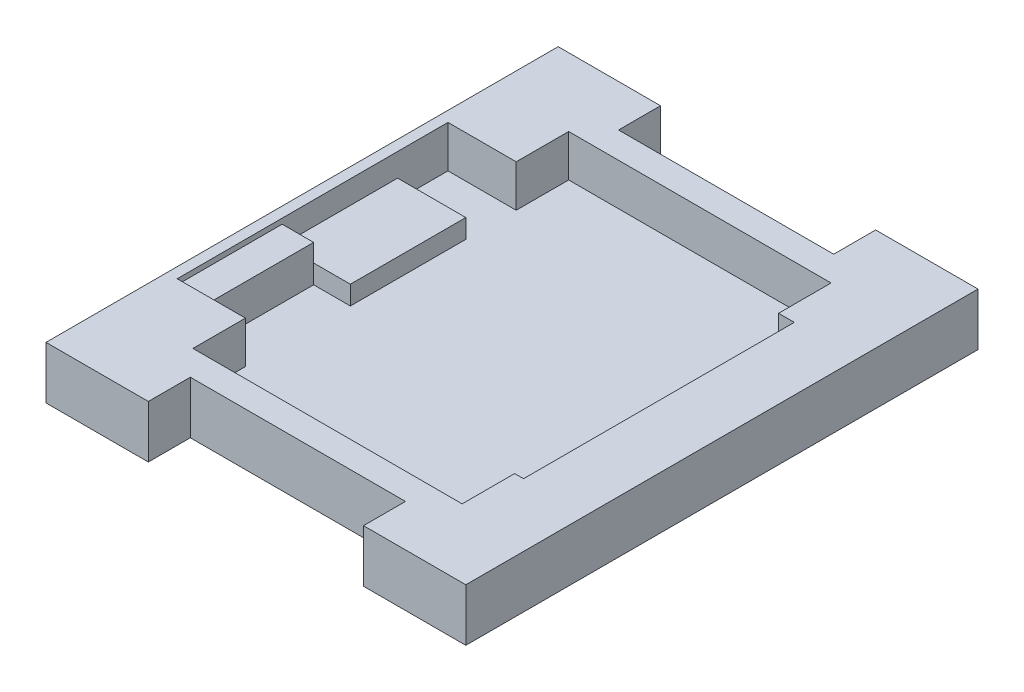
ISO-10303-21;
HEADER;
FILE_DESCRIPTION(('STEP AP214'),'2;1');
FILE_NAME('part.step','',(''),(''),'','','');
FILE_SCHEMA(('AUTOMOTIVE_DESIGN { 1 0 10303 214 1 1 1 1 }'));
ENDSEC;
DATA;
#1=APPLICATION_CONTEXT('core data for automotive mechanical design processes');
#2=APPLICATION_PROTOCOL_DEFINITION('international standard','automotive_design',2000,#1);
#3=PRODUCT_CONTEXT('',#1,'mechanical');
#4=PRODUCT('Part','Part','',(#3));
#5=PRODUCT_RELATED_PRODUCT_CATEGORY('part','',(#4));
#6=PRODUCT_DEFINITION_FORMATION('','',#4);
#7=PRODUCT_DEFINITION_CONTEXT('part definition',#1,'design');
#8=PRODUCT_DEFINITION('design','',#6,#7);
#9=PRODUCT_DEFINITION_SHAPE('','',#8);
#10=(LENGTH_UNIT() NAMED_UNIT(*) SI_UNIT(.MILLI.,.METRE.));
#11=(NAMED_UNIT(*) PLANE_ANGLE_UNIT() SI_UNIT($,.RADIAN.));
#12=(NAMED_UNIT(*) SI_UNIT($,.STERADIAN.) SOLID_ANGLE_UNIT());
#13=UNCERTAINTY_MEASURE_WITH_UNIT(LENGTH_MEASURE(1.E-05),#10,'distance_accuracy_value','');
#14=(GEOMETRIC_REPRESENTATION_CONTEXT(3) GLOBAL_UNCERTAINTY_ASSIGNED_CONTEXT((#13)) GLOBAL_UNIT_ASSIGNED_CONTEXT((#10,
#11,#12)) REPRESENTATION_CONTEXT('',''));
#15=CARTESIAN_POINT('',(0.,0.,0.));
#16=DIRECTION('',(0.,0.,1.));
#17=DIRECTION('',(1.,0.,0.));
#18=AXIS2_PLACEMENT_3D('',#15,#16,#17);
#19=CARTESIAN_POINT('',(0.,1.,0.));
#20=DIRECTION('',(0.,1.,0.));
#21=DIRECTION('',(0.,0.,1.));
#22=AXIS2_PLACEMENT_3D('',#19,#20,#21);
#23=PLANE('',#22);
#24=DIRECTION('',(1.,0.,0.));
#25=VECTOR('',#24,1.);
#26=CARTESIAN_POINT('',(0.,1.,2.90000000000001));
#27=LINE('',#26,#25);
#28=CARTESIAN_POINT('',(-16.,1.,2.90000000000001));
#29=VERTEX_POINT('',#28);
#30=CARTESIAN_POINT('',(-12.5,1.,2.90000000000001));
#31=VERTEX_POINT('',#30);
#32=EDGE_CURVE('E46',#29,#31,#27,.T.);
#33=ORIENTED_EDGE('',*,*,#32,.F.);
#34=DIRECTION('',(0.,0.,1.));
#35=VECTOR('',#34,1.);
#36=CARTESIAN_POINT('',(-16.,1.,0.));
#37=LINE('',#36,#35);
#38=CARTESIAN_POINT('',(-16.,1.,12.9));
#39=VERTEX_POINT('',#38);
#40=EDGE_CURVE('E266',#29,#39,#37,.T.);
#41=ORIENTED_EDGE('',*,*,#40,.T.);
#42=DIRECTION('',(-1.,0.,0.));
#43=VECTOR('',#42,1.);
#44=CARTESIAN_POINT('',(0.,1.,12.9));
#45=LINE('',#44,#43);
#46=CARTESIAN_POINT('',(-12.5,1.,12.9));
#47=VERTEX_POINT('',#46);
#48=EDGE_CURVE('E449',#47,#39,#45,.T.);
#49=ORIENTED_EDGE('',*,*,#48,.F.);
#50=DIRECTION('',(0.,0.,-1.));
#51=VECTOR('',#50,1.);
#52=CARTESIAN_POINT('',(-12.5,1.,0.));
#53=LINE('',#52,#51);
#54=CARTESIAN_POINT('',(-12.5,1.,17.9));
#55=VERTEX_POINT('',#54);
#56=EDGE_CURVE('E446',#55,#47,#53,.T.);
#57=ORIENTED_EDGE('',*,*,#56,.F.);
#58=DIRECTION('',(1.,0.,0.));
#59=VECTOR('',#58,1.);
#60=CARTESIAN_POINT('',(19.,1.,17.9));
#61=LINE('',#60,#59);
#62=CARTESIAN_POINT('',(13.1508427136181,1.,17.9));
#63=VERTEX_POINT('',#62);
#64=EDGE_CURVE('E400',#55,#63,#61,.T.);
#65=ORIENTED_EDGE('',*,*,#64,.T.);
#66=DIRECTION('',(0.,0.,1.));
#67=VECTOR('',#66,1.);
#68=CARTESIAN_POINT('',(13.1508427136181,1.,0.));
#69=LINE('',#68,#67);
#70=CARTESIAN_POINT('',(13.1508427136181,1.,12.9));
#71=VERTEX_POINT('',#70);
#72=EDGE_CURVE('E469',#71,#63,#69,.T.);
#73=ORIENTED_EDGE('',*,*,#72,.F.);
#74=DIRECTION('',(-1.,0.,0.));
#75=VECTOR('',#74,1.);
#76=CARTESIAN_POINT('',(0.,1.,12.9));
#77=LINE('',#76,#75);
#78=CARTESIAN_POINT('',(14.,1.,12.9));
#79=VERTEX_POINT('',#78);
#80=EDGE_CURVE('E466',#79,#71,#77,.T.);
#81=ORIENTED_EDGE('',*,*,#80,.F.);
#82=DIRECTION('',(0.,0.,1.));
#83=VECTOR('',#82,1.);
#84=CARTESIAN_POINT('',(14.,1.,0.));
#85=LINE('',#84,#83);
#86=CARTESIAN_POINT('',(14.,1.,-12.9));
#87=VERTEX_POINT('',#86);
#88=EDGE_CURVE('E463',#87,#79,#85,.T.);
#89=ORIENTED_EDGE('',*,*,#88,.F.);
#90=DIRECTION('',(1.,0.,0.));
#91=VECTOR('',#90,1.);
#92=CARTESIAN_POINT('',(0.,1.,-12.9));
#93=LINE('',#92,#91);
#94=CARTESIAN_POINT('',(12.5,1.,-12.9));
#95=VERTEX_POINT('',#94);
#96=EDGE_CURVE('E460',#95,#87,#93,.T.);
#97=ORIENTED_EDGE('',*,*,#96,.F.);
#98=DIRECTION('',(0.,0.,1.));
#99=VECTOR('',#98,1.);
#100=CARTESIAN_POINT('',(12.5,1.,0.));
#101=LINE('',#100,#99);
#102=CARTESIAN_POINT('',(12.5,1.,-17.9));
#103=VERTEX_POINT('',#102);
#104=EDGE_CURVE('E457',#103,#95,#101,.T.);
#105=ORIENTED_EDGE('',*,*,#104,.F.);
#106=DIRECTION('',(-1.,0.,0.));
#107=VECTOR('',#106,1.);
#108=CARTESIAN_POINT('',(19.,1.,-17.9));
#109=LINE('',#108,#107);
#110=CARTESIAN_POINT('',(-12.5,1.,-17.9));
#111=VERTEX_POINT('',#110);
#112=EDGE_CURVE('E394',#103,#111,#109,.T.);
#113=ORIENTED_EDGE('',*,*,#112,.T.);
#114=DIRECTION('',(0.,0.,-1.));
#115=VECTOR('',#114,1.);
#116=CARTESIAN_POINT('',(-12.5,1.,0.));
#117=LINE('',#116,#115);
#118=CARTESIAN_POINT('',(-12.5,1.,-12.9));
#119=VERTEX_POINT('',#118);
#120=EDGE_CURVE('E454',#119,#111,#117,.T.);
#121=ORIENTED_EDGE('',*,*,#120,.F.);
#122=DIRECTION('',(1.,0.,0.));
#123=VECTOR('',#122,1.);
#124=CARTESIAN_POINT('',(0.,1.,-12.9));
#125=LINE('',#124,#123);
#126=CARTESIAN_POINT('',(-19.,1.,-12.9));
#127=VERTEX_POINT('',#126);
#128=EDGE_CURVE('E451',#127,#119,#125,.T.);
#129=ORIENTED_EDGE('',*,*,#128,.F.);
#130=DIRECTION('',(0.,0.,1.));
#131=VECTOR('',#130,1.);
#132=CARTESIAN_POINT('',(-19.,1.,17.9));
#133=LINE('',#132,#131);
#134=CARTESIAN_POINT('',(-19.,1.,-8.09999999999999));
#135=VERTEX_POINT('',#134);
#136=EDGE_CURVE('E389',#127,#135,#133,.T.);
#137=ORIENTED_EDGE('',*,*,#136,.T.);
#138=DIRECTION('',(-1.,0.,0.));
#139=VECTOR('',#138,1.);
#140=CARTESIAN_POINT('',(0.,1.,-8.09999999999999));
#141=LINE('',#140,#139);
#142=CARTESIAN_POINT('',(-12.5,1.,-8.09999999999999));
#143=VERTEX_POINT('',#142);
#144=EDGE_CURVE('E472',#143,#135,#141,.T.);
#145=ORIENTED_EDGE('',*,*,#144,.F.);
#146=DIRECTION('',(0.,0.,-1.));
#147=VECTOR('',#146,1.);
#148=CARTESIAN_POINT('',(-12.5,1.,0.));
#149=LINE('',#148,#147);
#150=EDGE_CURVE('E475',#31,#143,#149,.T.);
#151=ORIENTED_EDGE('',*,*,#150,.F.);
#152=EDGE_LOOP('',(#33,#41,#49,#57,#65,#73,#81,#89,#97,#105,#113,#121,#129,#137,#145,#151));
#153=FACE_BOUND('',#152,.T.);
#154=ADVANCED_FACE('F38',(#153),#23,.T.);
#155=CARTESIAN_POINT('',(-19.5,2.8,2.90000000000001));
#156=DIRECTION('',(0.,0.,1.));
#157=DIRECTION('',(1.,0.,0.));
#158=AXIS2_PLACEMENT_3D('',#155,#156,#157);
#159=PLANE('',#158);
#160=DIRECTION('',(-1.,0.,0.));
#161=VECTOR('',#160,1.);
#162=CARTESIAN_POINT('',(-19.5,2.8,2.90000000000001));
#163=LINE('',#162,#161);
#164=CARTESIAN_POINT('',(-12.5,2.8,2.90000000000001));
#165=VERTEX_POINT('',#164);
#166=CARTESIAN_POINT('',(-16.,2.8,2.90000000000001));
#167=VERTEX_POINT('',#166);
#168=EDGE_CURVE('E275',#165,#167,#163,.T.);
#169=ORIENTED_EDGE('',*,*,#168,.T.);
#170=DIRECTION('',(0.,-1.,0.));
#171=VECTOR('',#170,1.);
#172=CARTESIAN_POINT('',(-16.,0.,2.90000000000001));
#173=LINE('',#172,#171);
#174=EDGE_CURVE('E258',#167,#29,#173,.T.);
#175=ORIENTED_EDGE('',*,*,#174,.T.);
#176=ORIENTED_EDGE('',*,*,#32,.T.);
#177=DIRECTION('',(0.,-1.,0.));
#178=VECTOR('',#177,1.);
#179=CARTESIAN_POINT('',(-12.5,2.8,2.90000000000001));
#180=LINE('',#179,#178);
#181=EDGE_CURVE('E279',#165,#31,#180,.T.);
#182=ORIENTED_EDGE('',*,*,#181,.F.);
#183=EDGE_LOOP('',(#169,#175,#176,#182));
#184=FACE_BOUND('',#183,.T.);
#185=ADVANCED_FACE('F480',(#184),#159,.T.);
#186=CARTESIAN_POINT('',(20.,1.,-24.4));
#187=DIRECTION('',(0.,0.,1.));
#188=DIRECTION('',(1.,0.,0.));
#189=AXIS2_PLACEMENT_3D('',#186,#187,#188);
#190=PLANE('',#189);
#191=DIRECTION('',(-1.,0.,0.));
#192=VECTOR('',#191,1.);
#193=CARTESIAN_POINT('',(20.,5.,-24.4));
#194=LINE('',#193,#192);
#195=CARTESIAN_POINT('',(-10.25,5.,-24.4));
#196=VERTEX_POINT('',#195);
#197=CARTESIAN_POINT('',(-20.,5.,-24.4));
#198=VERTEX_POINT('',#197);
#199=EDGE_CURVE('E413',#196,#198,#194,.T.);
#200=ORIENTED_EDGE('',*,*,#199,.F.);
#201=DIRECTION('',(0.,-1.,0.));
#202=VECTOR('',#201,1.);
#203=CARTESIAN_POINT('',(-10.25,1.,-24.4));
#204=LINE('',#203,#202);
#205=CARTESIAN_POINT('',(-10.25,0.,-24.4));
#206=VERTEX_POINT('',#205);
#207=EDGE_CURVE('E361',#196,#206,#204,.T.);
#208=ORIENTED_EDGE('',*,*,#207,.T.);
#209=DIRECTION('',(-1.,0.,0.));
#210=VECTOR('',#209,1.);
#211=CARTESIAN_POINT('',(20.,0.,-24.4));
#212=LINE('',#211,#210);
#213=CARTESIAN_POINT('',(-20.,0.,-24.4));
#214=VERTEX_POINT('',#213);
#215=EDGE_CURVE('E425',#206,#214,#212,.T.);
#216=ORIENTED_EDGE('',*,*,#215,.T.);
#217=DIRECTION('',(0.,-1.,0.));
#218=VECTOR('',#217,1.);
#219=CARTESIAN_POINT('',(-20.,1.,-24.4));
#220=LINE('',#219,#218);
#221=EDGE_CURVE('E429',#198,#214,#220,.T.);
#222=ORIENTED_EDGE('',*,*,#221,.F.);
#223=EDGE_LOOP('',(#200,#208,#216,#222));
#224=FACE_BOUND('',#223,.T.);
#225=ADVANCED_FACE('F511',(#224),#190,.F.);
#226=CARTESIAN_POINT('',(20.,1.,24.4));
#227=DIRECTION('',(0.,0.,-1.));
#228=DIRECTION('',(-1.,0.,0.));
#229=AXIS2_PLACEMENT_3D('',#226,#227,#228);
#230=PLANE('',#229);
#231=DIRECTION('',(1.,0.,0.));
#232=VECTOR('',#231,1.);
#233=CARTESIAN_POINT('',(20.,0.,24.4));
#234=LINE('',#233,#232);
#235=CARTESIAN_POINT('',(-20.,0.,24.4));
#236=VERTEX_POINT('',#235);
#237=CARTESIAN_POINT('',(-10.25,0.,24.4));
#238=VERTEX_POINT('',#237);
#239=EDGE_CURVE('E420',#236,#238,#234,.T.);
#240=ORIENTED_EDGE('',*,*,#239,.T.);
#241=DIRECTION('',(0.,1.,0.));
#242=VECTOR('',#241,1.);
#243=CARTESIAN_POINT('',(-10.25,1.,24.4));
#244=LINE('',#243,#242);
#245=CARTESIAN_POINT('',(-10.25,5.,24.4));
#246=VERTEX_POINT('',#245);
#247=EDGE_CURVE('E386',#238,#246,#244,.T.);
#248=ORIENTED_EDGE('',*,*,#247,.T.);
#249=DIRECTION('',(1.,0.,0.));
#250=VECTOR('',#249,1.);
#251=CARTESIAN_POINT('',(20.,5.,24.4));
#252=LINE('',#251,#250);
#253=CARTESIAN_POINT('',(-20.,5.,24.4));
#254=VERTEX_POINT('',#253);
#255=EDGE_CURVE('E407',#254,#246,#252,.T.);
#256=ORIENTED_EDGE('',*,*,#255,.F.);
#257=DIRECTION('',(0.,-1.,0.));
#258=VECTOR('',#257,1.);
#259=CARTESIAN_POINT('',(-20.,1.,24.4));
#260=LINE('',#259,#258);
#261=EDGE_CURVE('E438',#254,#236,#260,.T.);
#262=ORIENTED_EDGE('',*,*,#261,.T.);
#263=EDGE_LOOP('',(#240,#248,#256,#262));
#264=FACE_BOUND('',#263,.T.);
#265=ADVANCED_FACE('F527',(#264),#230,.F.);
#266=CARTESIAN_POINT('',(-20.,1.,24.4));
#267=DIRECTION('',(1.,0.,0.));
#268=DIRECTION('',(0.,0.,-1.));
#269=AXIS2_PLACEMENT_3D('',#266,#267,#268);
#270=PLANE('',#269);
#271=DIRECTION('',(0.,0.,1.));
#272=VECTOR('',#271,1.);
#273=CARTESIAN_POINT('',(-20.,0.,24.4));
#274=LINE('',#273,#272);
#275=EDGE_CURVE('E417',#214,#236,#274,.T.);
#276=ORIENTED_EDGE('',*,*,#275,.T.);
#277=ORIENTED_EDGE('',*,*,#261,.F.);
#278=DIRECTION('',(0.,0.,1.));
#279=VECTOR('',#278,1.);
#280=CARTESIAN_POINT('',(-20.,5.,24.4));
#281=LINE('',#280,#279);
#282=EDGE_CURVE('E398',#198,#254,#281,.T.);
#283=ORIENTED_EDGE('',*,*,#282,.F.);
#284=ORIENTED_EDGE('',*,*,#221,.T.);
#285=EDGE_LOOP('',(#276,#277,#283,#284));
#286=FACE_BOUND('',#285,.T.);
#287=ADVANCED_FACE('F40',(#286),#270,.F.);
#288=CARTESIAN_POINT('',(10.25,5.,24.4));
#289=VERTEX_POINT('',#288);
#290=CARTESIAN_POINT('',(20.,5.,24.4));
#291=VERTEX_POINT('',#290);
#292=EDGE_CURVE('E406',#289,#291,#252,.T.);
#293=ORIENTED_EDGE('',*,*,#292,.F.);
#294=DIRECTION('',(0.,-1.,0.));
#295=VECTOR('',#294,1.);
#296=CARTESIAN_POINT('',(10.25,1.,24.4));
#297=LINE('',#296,#295);
#298=CARTESIAN_POINT('',(10.25,0.,24.4));
#299=VERTEX_POINT('',#298);
#300=EDGE_CURVE('E381',#289,#299,#297,.T.);
#301=ORIENTED_EDGE('',*,*,#300,.T.);
#302=CARTESIAN_POINT('',(20.,0.,24.4));
#303=VERTEX_POINT('',#302);
#304=EDGE_CURVE('E419',#299,#303,#234,.T.);
#305=ORIENTED_EDGE('',*,*,#304,.T.);
#306=DIRECTION('',(0.,-1.,0.));
#307=VECTOR('',#306,1.);
#308=CARTESIAN_POINT('',(20.,1.,24.4));
#309=LINE('',#308,#307);
#310=EDGE_CURVE('E435',#291,#303,#309,.T.);
#311=ORIENTED_EDGE('',*,*,#310,.F.);
#312=EDGE_LOOP('',(#293,#301,#305,#311));
#313=FACE_BOUND('',#312,.T.);
#314=ADVANCED_FACE('F523',(#313),#230,.F.);
#315=CARTESIAN_POINT('',(20.,1.,24.4));
#316=DIRECTION('',(-1.,0.,0.));
#317=DIRECTION('',(0.,0.,1.));
#318=AXIS2_PLACEMENT_3D('',#315,#316,#317);
#319=PLANE('',#318);
#320=DIRECTION('',(0.,0.,-1.));
#321=VECTOR('',#320,1.);
#322=CARTESIAN_POINT('',(20.,0.,24.4));
#323=LINE('',#322,#321);
#324=CARTESIAN_POINT('',(20.,0.,-24.4));
#325=VERTEX_POINT('',#324);
#326=EDGE_CURVE('E423',#303,#325,#323,.T.);
#327=ORIENTED_EDGE('',*,*,#326,.T.);
#328=DIRECTION('',(0.,-1.,0.));
#329=VECTOR('',#328,1.);
#330=CARTESIAN_POINT('',(20.,1.,-24.4));
#331=LINE('',#330,#329);
#332=CARTESIAN_POINT('',(20.,5.,-24.4));
#333=VERTEX_POINT('',#332);
#334=EDGE_CURVE('E432',#333,#325,#331,.T.);
#335=ORIENTED_EDGE('',*,*,#334,.F.);
#336=DIRECTION('',(0.,0.,-1.));
#337=VECTOR('',#336,1.);
#338=CARTESIAN_POINT('',(20.,5.,24.4));
#339=LINE('',#338,#337);
#340=EDGE_CURVE('E410',#291,#333,#339,.T.);
#341=ORIENTED_EDGE('',*,*,#340,.F.);
#342=ORIENTED_EDGE('',*,*,#310,.T.);
#343=EDGE_LOOP('',(#327,#335,#341,#342));
#344=FACE_BOUND('',#343,.T.);
#345=ADVANCED_FACE('F520',(#344),#319,.F.);
#346=CARTESIAN_POINT('',(10.25,0.,-24.4));
#347=VERTEX_POINT('',#346);
#348=EDGE_CURVE('E426',#325,#347,#212,.T.);
#349=ORIENTED_EDGE('',*,*,#348,.T.);
#350=DIRECTION('',(0.,1.,0.));
#351=VECTOR('',#350,1.);
#352=CARTESIAN_POINT('',(10.25,1.,-24.4));
#353=LINE('',#352,#351);
#354=CARTESIAN_POINT('',(10.25,5.,-24.4));
#355=VERTEX_POINT('',#354);
#356=EDGE_CURVE('E357',#347,#355,#353,.T.);
#357=ORIENTED_EDGE('',*,*,#356,.T.);
#358=EDGE_CURVE('E414',#333,#355,#194,.T.);
#359=ORIENTED_EDGE('',*,*,#358,.F.);
#360=ORIENTED_EDGE('',*,*,#334,.T.);
#361=EDGE_LOOP('',(#349,#357,#359,#360));
#362=FACE_BOUND('',#361,.T.);
#363=ADVANCED_FACE('F516',(#362),#190,.F.);
#364=CARTESIAN_POINT('',(0.,0.,0.));
#365=DIRECTION('',(0.,1.,0.));
#366=DIRECTION('',(0.,0.,1.));
#367=AXIS2_PLACEMENT_3D('',#364,#365,#366);
#368=PLANE('',#367);
#369=ORIENTED_EDGE('',*,*,#239,.F.);
#370=ORIENTED_EDGE('',*,*,#275,.F.);
#371=ORIENTED_EDGE('',*,*,#215,.F.);
#372=DIRECTION('',(0.,0.,1.));
#373=VECTOR('',#372,1.);
#374=CARTESIAN_POINT('',(-10.25,0.,-28.4));
#375=LINE('',#374,#373);
#376=CARTESIAN_POINT('',(-10.25,0.,-20.4));
#377=VERTEX_POINT('',#376);
#378=EDGE_CURVE('E341',#206,#377,#375,.T.);
#379=ORIENTED_EDGE('',*,*,#378,.T.);
#380=DIRECTION('',(1.,0.,0.));
#381=VECTOR('',#380,1.);
#382=CARTESIAN_POINT('',(10.25,0.,-20.4));
#383=LINE('',#382,#381);
#384=CARTESIAN_POINT('',(10.25,0.,-20.4));
#385=VERTEX_POINT('',#384);
#386=EDGE_CURVE('E344',#377,#385,#383,.T.);
#387=ORIENTED_EDGE('',*,*,#386,.T.);
#388=DIRECTION('',(0.,0.,-1.));
#389=VECTOR('',#388,1.);
#390=CARTESIAN_POINT('',(10.25,0.,-28.4));
#391=LINE('',#390,#389);
#392=EDGE_CURVE('E348',#385,#347,#391,.T.);
#393=ORIENTED_EDGE('',*,*,#392,.T.);
#394=ORIENTED_EDGE('',*,*,#348,.F.);
#395=ORIENTED_EDGE('',*,*,#326,.F.);
#396=ORIENTED_EDGE('',*,*,#304,.F.);
#397=DIRECTION('',(0.,0.,-1.));
#398=VECTOR('',#397,1.);
#399=CARTESIAN_POINT('',(10.25,0.,28.4));
#400=LINE('',#399,#398);
#401=CARTESIAN_POINT('',(10.25,0.,20.4));
#402=VERTEX_POINT('',#401);
#403=EDGE_CURVE('E368',#299,#402,#400,.T.);
#404=ORIENTED_EDGE('',*,*,#403,.T.);
#405=DIRECTION('',(-1.,0.,0.));
#406=VECTOR('',#405,1.);
#407=CARTESIAN_POINT('',(10.25,0.,20.4));
#408=LINE('',#407,#406);
#409=CARTESIAN_POINT('',(-10.25,0.,20.4));
#410=VERTEX_POINT('',#409);
#411=EDGE_CURVE('E372',#402,#410,#408,.T.);
#412=ORIENTED_EDGE('',*,*,#411,.T.);
#413=DIRECTION('',(0.,0.,1.));
#414=VECTOR('',#413,1.);
#415=CARTESIAN_POINT('',(-10.25,0.,28.4));
#416=LINE('',#415,#414);
#417=EDGE_CURVE('E365',#410,#238,#416,.T.);
#418=ORIENTED_EDGE('',*,*,#417,.T.);
#419=EDGE_LOOP('',(#369,#370,#371,#379,#387,#393,#394,#395,#396,#404,#412,#418));
#420=FACE_BOUND('',#419,.T.);
#421=ADVANCED_FACE('F503',(#420),#368,.F.);
#422=CARTESIAN_POINT('',(0.,5.,0.));
#423=DIRECTION('',(0.,1.,0.));
#424=DIRECTION('',(0.,0.,1.));
#425=AXIS2_PLACEMENT_3D('',#422,#423,#424);
#426=PLANE('',#425);
#427=DIRECTION('',(0.,0.,1.));
#428=VECTOR('',#427,1.);
#429=CARTESIAN_POINT('',(-19.,5.,17.9));
#430=LINE('',#429,#428);
#431=CARTESIAN_POINT('',(-19.,5.,-12.9));
#432=VERTEX_POINT('',#431);
#433=CARTESIAN_POINT('',(-19.,5.,12.9));
#434=VERTEX_POINT('',#433);
#435=EDGE_CURVE('E390',#432,#434,#430,.T.);
#436=ORIENTED_EDGE('',*,*,#435,.F.);
#437=DIRECTION('',(1.,0.,0.));
#438=VECTOR('',#437,1.);
#439=CARTESIAN_POINT('',(-19.,5.,-12.9));
#440=LINE('',#439,#438);
#441=CARTESIAN_POINT('',(-12.5,5.,-12.9));
#442=VERTEX_POINT('',#441);
#443=EDGE_CURVE('E306',#432,#442,#440,.T.);
#444=ORIENTED_EDGE('',*,*,#443,.T.);
#445=DIRECTION('',(0.,0.,-1.));
#446=VECTOR('',#445,1.);
#447=CARTESIAN_POINT('',(-12.5,5.,-17.9));
#448=LINE('',#447,#446);
#449=CARTESIAN_POINT('',(-12.5,5.,-17.9));
#450=VERTEX_POINT('',#449);
#451=EDGE_CURVE('E318',#442,#450,#448,.T.);
#452=ORIENTED_EDGE('',*,*,#451,.T.);
#453=DIRECTION('',(-1.,0.,0.));
#454=VECTOR('',#453,1.);
#455=CARTESIAN_POINT('',(19.,5.,-17.9));
#456=LINE('',#455,#454);
#457=CARTESIAN_POINT('',(12.5,5.,-17.9));
#458=VERTEX_POINT('',#457);
#459=EDGE_CURVE('E396',#458,#450,#456,.T.);
#460=ORIENTED_EDGE('',*,*,#459,.F.);
#461=DIRECTION('',(0.,0.,1.));
#462=VECTOR('',#461,1.);
#463=CARTESIAN_POINT('',(12.5,5.,-12.9));
#464=LINE('',#463,#462);
#465=CARTESIAN_POINT('',(12.5,5.,-12.9));
#466=VERTEX_POINT('',#465);
#467=EDGE_CURVE('E287',#458,#466,#464,.T.);
#468=ORIENTED_EDGE('',*,*,#467,.T.);
#469=DIRECTION('',(1.,0.,0.));
#470=VECTOR('',#469,1.);
#471=CARTESIAN_POINT('',(14.,5.,-12.9));
#472=LINE('',#471,#470);
#473=CARTESIAN_POINT('',(14.,5.,-12.9));
#474=VERTEX_POINT('',#473);
#475=EDGE_CURVE('E290',#466,#474,#472,.T.);
#476=ORIENTED_EDGE('',*,*,#475,.T.);
#477=DIRECTION('',(0.,0.,1.));
#478=VECTOR('',#477,1.);
#479=CARTESIAN_POINT('',(14.,5.,12.9));
#480=LINE('',#479,#478);
#481=CARTESIAN_POINT('',(14.,5.,12.9));
#482=VERTEX_POINT('',#481);
#483=EDGE_CURVE('E293',#474,#482,#480,.T.);
#484=ORIENTED_EDGE('',*,*,#483,.T.);
#485=DIRECTION('',(-1.,0.,0.));
#486=VECTOR('',#485,1.);
#487=CARTESIAN_POINT('',(13.1508427136181,5.,12.9));
#488=LINE('',#487,#486);
#489=CARTESIAN_POINT('',(13.1508427136181,5.,12.9));
#490=VERTEX_POINT('',#489);
#491=EDGE_CURVE('E296',#482,#490,#488,.T.);
#492=ORIENTED_EDGE('',*,*,#491,.T.);
#493=DIRECTION('',(0.,0.,1.));
#494=VECTOR('',#493,1.);
#495=CARTESIAN_POINT('',(13.1508427136181,5.,17.9));
#496=LINE('',#495,#494);
#497=CARTESIAN_POINT('',(13.1508427136181,5.,17.9));
#498=VERTEX_POINT('',#497);
#499=EDGE_CURVE('E299',#490,#498,#496,.T.);
#500=ORIENTED_EDGE('',*,*,#499,.T.);
#501=DIRECTION('',(1.,0.,0.));
#502=VECTOR('',#501,1.);
#503=CARTESIAN_POINT('',(19.,5.,17.9));
#504=LINE('',#503,#502);
#505=CARTESIAN_POINT('',(-12.5,5.,17.9));
#506=VERTEX_POINT('',#505);
#507=EDGE_CURVE('E393',#506,#498,#504,.T.);
#508=ORIENTED_EDGE('',*,*,#507,.F.);
#509=DIRECTION('',(0.,0.,-1.));
#510=VECTOR('',#509,1.);
#511=CARTESIAN_POINT('',(-12.5,5.,17.9));
#512=LINE('',#511,#510);
#513=CARTESIAN_POINT('',(-12.5,5.,12.9));
#514=VERTEX_POINT('',#513);
#515=EDGE_CURVE('E325',#506,#514,#512,.T.);
#516=ORIENTED_EDGE('',*,*,#515,.T.);
#517=DIRECTION('',(-1.,0.,0.));
#518=VECTOR('',#517,1.);
#519=CARTESIAN_POINT('',(-19.,5.,12.9));
#520=LINE('',#519,#518);
#521=EDGE_CURVE('E331',#514,#434,#520,.T.);
#522=ORIENTED_EDGE('',*,*,#521,.T.);
#523=EDGE_LOOP('',(#436,#444,#452,#460,#468,#476,#484,#492,#500,#508,#516,#522));
#524=FACE_BOUND('',#523,.T.);
#525=DIRECTION('',(0.,0.,1.));
#526=VECTOR('',#525,1.);
#527=CARTESIAN_POINT('',(-10.25,5.,0.));
#528=LINE('',#527,#526);
#529=CARTESIAN_POINT('',(-10.25,5.,-20.4));
#530=VERTEX_POINT('',#529);
#531=EDGE_CURVE('E443',#196,#530,#528,.T.);
#532=ORIENTED_EDGE('',*,*,#531,.F.);
#533=ORIENTED_EDGE('',*,*,#199,.T.);
#534=ORIENTED_EDGE('',*,*,#282,.T.);
#535=ORIENTED_EDGE('',*,*,#255,.T.);
#536=DIRECTION('',(0.,0.,1.));
#537=VECTOR('',#536,1.);
#538=CARTESIAN_POINT('',(-10.25,5.,28.4));
#539=LINE('',#538,#537);
#540=CARTESIAN_POINT('',(-10.25,5.,20.4));
#541=VERTEX_POINT('',#540);
#542=EDGE_CURVE('E364',#541,#246,#539,.T.);
#543=ORIENTED_EDGE('',*,*,#542,.F.);
#544=DIRECTION('',(-1.,0.,0.));
#545=VECTOR('',#544,1.);
#546=CARTESIAN_POINT('',(10.25,5.,20.4));
#547=LINE('',#546,#545);
#548=CARTESIAN_POINT('',(10.25,5.,20.4));
#549=VERTEX_POINT('',#548);
#550=EDGE_CURVE('E369',#549,#541,#547,.T.);
#551=ORIENTED_EDGE('',*,*,#550,.F.);
#552=DIRECTION('',(0.,0.,-1.));
#553=VECTOR('',#552,1.);
#554=CARTESIAN_POINT('',(10.25,5.,0.));
#555=LINE('',#554,#553);
#556=EDGE_CURVE('E441',#289,#549,#555,.T.);
#557=ORIENTED_EDGE('',*,*,#556,.F.);
#558=ORIENTED_EDGE('',*,*,#292,.T.);
#559=ORIENTED_EDGE('',*,*,#340,.T.);
#560=ORIENTED_EDGE('',*,*,#358,.T.);
#561=DIRECTION('',(0.,0.,-1.));
#562=VECTOR('',#561,1.);
#563=CARTESIAN_POINT('',(10.25,5.,-28.4));
#564=LINE('',#563,#562);
#565=CARTESIAN_POINT('',(10.25,5.,-20.4));
#566=VERTEX_POINT('',#565);
#567=EDGE_CURVE('E345',#566,#355,#564,.T.);
#568=ORIENTED_EDGE('',*,*,#567,.F.);
#569=DIRECTION('',(1.,0.,0.));
#570=VECTOR('',#569,1.);
#571=CARTESIAN_POINT('',(10.25,5.,-20.4));
#572=LINE('',#571,#570);
#573=EDGE_CURVE('E337',#530,#566,#572,.T.);
#574=ORIENTED_EDGE('',*,*,#573,.F.);
#575=EDGE_LOOP('',(#532,#533,#534,#535,#543,#551,#557,#558,#559,#560,#568,#574));
#576=FACE_BOUND('',#575,.T.);
#577=ADVANCED_FACE('F494',(#524,#576),#426,.T.);
#578=CARTESIAN_POINT('',(-19.,5.,17.9));
#579=DIRECTION('',(1.,0.,0.));
#580=DIRECTION('',(0.,0.,-1.));
#581=AXIS2_PLACEMENT_3D('',#578,#579,#580);
#582=PLANE('',#581);
#583=DIRECTION('',(0.,1.,0.));
#584=VECTOR('',#583,1.);
#585=CARTESIAN_POINT('',(-19.,5.,2.90000000000001));
#586=LINE('',#585,#584);
#587=CARTESIAN_POINT('',(-19.,2.8,2.90000000000001));
#588=VERTEX_POINT('',#587);
#589=CARTESIAN_POINT('',(-19.,4.5,2.90000000000001));
#590=VERTEX_POINT('',#589);
#591=EDGE_CURVE('E247',#588,#590,#586,.T.);
#592=ORIENTED_EDGE('',*,*,#591,.F.);
#593=DIRECTION('',(0.,0.,1.));
#594=VECTOR('',#593,1.);
#595=CARTESIAN_POINT('',(-19.,2.8,17.9));
#596=LINE('',#595,#594);
#597=CARTESIAN_POINT('',(-19.,2.8,-8.09999999999999));
#598=VERTEX_POINT('',#597);
#599=EDGE_CURVE('E11',#598,#588,#596,.T.);
#600=ORIENTED_EDGE('',*,*,#599,.F.);
#601=DIRECTION('',(0.,1.,0.));
#602=VECTOR('',#601,1.);
#603=CARTESIAN_POINT('',(-19.,5.,-8.09999999999999));
#604=LINE('',#603,#602);
#605=EDGE_CURVE('E282',#135,#598,#604,.T.);
#606=ORIENTED_EDGE('',*,*,#605,.F.);
#607=ORIENTED_EDGE('',*,*,#136,.F.);
#608=DIRECTION('',(0.,1.,0.));
#609=VECTOR('',#608,1.);
#610=CARTESIAN_POINT('',(-19.,0.,-12.9));
#611=LINE('',#610,#609);
#612=EDGE_CURVE('E321',#127,#432,#611,.T.);
#613=ORIENTED_EDGE('',*,*,#612,.T.);
#614=ORIENTED_EDGE('',*,*,#435,.T.);
#615=DIRECTION('',(0.,1.,0.));
#616=VECTOR('',#615,1.);
#617=CARTESIAN_POINT('',(-19.,0.,12.9));
#618=LINE('',#617,#616);
#619=CARTESIAN_POINT('',(-19.,4.5,12.9));
#620=VERTEX_POINT('',#619);
#621=EDGE_CURVE('E335',#620,#434,#618,.T.);
#622=ORIENTED_EDGE('',*,*,#621,.F.);
#623=DIRECTION('',(0.,0.,1.));
#624=VECTOR('',#623,1.);
#625=CARTESIAN_POINT('',(-19.,4.5,17.9));
#626=LINE('',#625,#624);
#627=EDGE_CURVE('E53',#590,#620,#626,.T.);
#628=ORIENTED_EDGE('',*,*,#627,.F.);
#629=EDGE_LOOP('',(#592,#600,#606,#607,#613,#614,#622,#628));
#630=FACE_BOUND('',#629,.T.);
#631=ADVANCED_FACE('F491',(#630),#582,.T.);
#632=CARTESIAN_POINT('',(19.,5.,17.9));
#633=DIRECTION('',(0.,0.,-1.));
#634=DIRECTION('',(-1.,0.,0.));
#635=AXIS2_PLACEMENT_3D('',#632,#633,#634);
#636=PLANE('',#635);
#637=DIRECTION('',(0.,1.,0.));
#638=VECTOR('',#637,1.);
#639=CARTESIAN_POINT('',(13.1508427136181,0.,17.9));
#640=LINE('',#639,#638);
#641=EDGE_CURVE('E303',#63,#498,#640,.T.);
#642=ORIENTED_EDGE('',*,*,#641,.F.);
#643=ORIENTED_EDGE('',*,*,#64,.F.);
#644=DIRECTION('',(0.,1.,0.));
#645=VECTOR('',#644,1.);
#646=CARTESIAN_POINT('',(-12.5,0.,17.9));
#647=LINE('',#646,#645);
#648=EDGE_CURVE('E334',#55,#506,#647,.T.);
#649=ORIENTED_EDGE('',*,*,#648,.T.);
#650=ORIENTED_EDGE('',*,*,#507,.T.);
#651=EDGE_LOOP('',(#642,#643,#649,#650));
#652=FACE_BOUND('',#651,.T.);
#653=ADVANCED_FACE('F493',(#652),#636,.T.);
#654=CARTESIAN_POINT('',(19.,5.,-17.9));
#655=DIRECTION('',(0.,0.,1.));
#656=DIRECTION('',(1.,0.,0.));
#657=AXIS2_PLACEMENT_3D('',#654,#655,#656);
#658=PLANE('',#657);
#659=DIRECTION('',(0.,1.,0.));
#660=VECTOR('',#659,1.);
#661=CARTESIAN_POINT('',(12.5,0.,-17.9));
#662=LINE('',#661,#660);
#663=EDGE_CURVE('E302',#103,#458,#662,.T.);
#664=ORIENTED_EDGE('',*,*,#663,.T.);
#665=ORIENTED_EDGE('',*,*,#459,.T.);
#666=DIRECTION('',(0.,1.,0.));
#667=VECTOR('',#666,1.);
#668=CARTESIAN_POINT('',(-12.5,0.,-17.9));
#669=LINE('',#668,#667);
#670=EDGE_CURVE('E322',#111,#450,#669,.T.);
#671=ORIENTED_EDGE('',*,*,#670,.F.);
#672=ORIENTED_EDGE('',*,*,#112,.F.);
#673=EDGE_LOOP('',(#664,#665,#671,#672));
#674=FACE_BOUND('',#673,.T.);
#675=ADVANCED_FACE('F500',(#674),#658,.T.);
#676=CARTESIAN_POINT('',(-10.25,0.,28.4));
#677=DIRECTION('',(-1.,0.,0.));
#678=DIRECTION('',(0.,0.,1.));
#679=AXIS2_PLACEMENT_3D('',#676,#677,#678);
#680=PLANE('',#679);
#681=ORIENTED_EDGE('',*,*,#417,.F.);
#682=DIRECTION('',(0.,1.,0.));
#683=VECTOR('',#682,1.);
#684=CARTESIAN_POINT('',(-10.25,0.,20.4));
#685=LINE('',#684,#683);
#686=EDGE_CURVE('E379',#410,#541,#685,.T.);
#687=ORIENTED_EDGE('',*,*,#686,.T.);
#688=ORIENTED_EDGE('',*,*,#542,.T.);
#689=ORIENTED_EDGE('',*,*,#247,.F.);
#690=EDGE_LOOP('',(#681,#687,#688,#689));
#691=FACE_BOUND('',#690,.T.);
#692=ADVANCED_FACE('F546',(#691),#680,.F.);
#693=CARTESIAN_POINT('',(10.25,0.,28.4));
#694=DIRECTION('',(1.,0.,0.));
#695=DIRECTION('',(0.,0.,-1.));
#696=AXIS2_PLACEMENT_3D('',#693,#694,#695);
#697=PLANE('',#696);
#698=ORIENTED_EDGE('',*,*,#556,.T.);
#699=DIRECTION('',(0.,1.,0.));
#700=VECTOR('',#699,1.);
#701=CARTESIAN_POINT('',(10.25,0.,20.4));
#702=LINE('',#701,#700);
#703=EDGE_CURVE('E375',#402,#549,#702,.T.);
#704=ORIENTED_EDGE('',*,*,#703,.F.);
#705=ORIENTED_EDGE('',*,*,#403,.F.);
#706=ORIENTED_EDGE('',*,*,#300,.F.);
#707=EDGE_LOOP('',(#698,#704,#705,#706));
#708=FACE_BOUND('',#707,.T.);
#709=ADVANCED_FACE('F572',(#708),#697,.F.);
#710=CARTESIAN_POINT('',(10.25,0.,20.4));
#711=DIRECTION('',(0.,0.,-1.));
#712=DIRECTION('',(-1.,0.,0.));
#713=AXIS2_PLACEMENT_3D('',#710,#711,#712);
#714=PLANE('',#713);
#715=ORIENTED_EDGE('',*,*,#550,.T.);
#716=ORIENTED_EDGE('',*,*,#686,.F.);
#717=ORIENTED_EDGE('',*,*,#411,.F.);
#718=ORIENTED_EDGE('',*,*,#703,.T.);
#719=EDGE_LOOP('',(#715,#716,#717,#718));
#720=FACE_BOUND('',#719,.T.);
#721=ADVANCED_FACE('F574',(#720),#714,.F.);
#722=CARTESIAN_POINT('',(-10.25,0.,-28.4));
#723=DIRECTION('',(-1.,0.,0.));
#724=DIRECTION('',(0.,0.,1.));
#725=AXIS2_PLACEMENT_3D('',#722,#723,#724);
#726=PLANE('',#725);
#727=ORIENTED_EDGE('',*,*,#531,.T.);
#728=DIRECTION('',(0.,1.,0.));
#729=VECTOR('',#728,1.);
#730=CARTESIAN_POINT('',(-10.25,0.,-20.4));
#731=LINE('',#730,#729);
#732=EDGE_CURVE('E351',#377,#530,#731,.T.);
#733=ORIENTED_EDGE('',*,*,#732,.F.);
#734=ORIENTED_EDGE('',*,*,#378,.F.);
#735=ORIENTED_EDGE('',*,*,#207,.F.);
#736=EDGE_LOOP('',(#727,#733,#734,#735));
#737=FACE_BOUND('',#736,.T.);
#738=ADVANCED_FACE('F557',(#737),#726,.F.);
#739=CARTESIAN_POINT('',(10.25,0.,-28.4));
#740=DIRECTION('',(1.,0.,0.));
#741=DIRECTION('',(0.,0.,-1.));
#742=AXIS2_PLACEMENT_3D('',#739,#740,#741);
#743=PLANE('',#742);
#744=ORIENTED_EDGE('',*,*,#392,.F.);
#745=DIRECTION('',(0.,1.,0.));
#746=VECTOR('',#745,1.);
#747=CARTESIAN_POINT('',(10.25,0.,-20.4));
#748=LINE('',#747,#746);
#749=EDGE_CURVE('E355',#385,#566,#748,.T.);
#750=ORIENTED_EDGE('',*,*,#749,.T.);
#751=ORIENTED_EDGE('',*,*,#567,.T.);
#752=ORIENTED_EDGE('',*,*,#356,.F.);
#753=EDGE_LOOP('',(#744,#750,#751,#752));
#754=FACE_BOUND('',#753,.T.);
#755=ADVANCED_FACE('F564',(#754),#743,.F.);
#756=CARTESIAN_POINT('',(10.25,0.,-20.4));
#757=DIRECTION('',(0.,0.,1.));
#758=DIRECTION('',(1.,0.,0.));
#759=AXIS2_PLACEMENT_3D('',#756,#757,#758);
#760=PLANE('',#759);
#761=ORIENTED_EDGE('',*,*,#573,.T.);
#762=ORIENTED_EDGE('',*,*,#749,.F.);
#763=ORIENTED_EDGE('',*,*,#386,.F.);
#764=ORIENTED_EDGE('',*,*,#732,.T.);
#765=EDGE_LOOP('',(#761,#762,#763,#764));
#766=FACE_BOUND('',#765,.T.);
#767=ADVANCED_FACE('F560',(#766),#760,.F.);
#768=CARTESIAN_POINT('',(-19.,0.,12.9));
#769=DIRECTION('',(0.,0.,-1.));
#770=DIRECTION('',(-1.,0.,0.));
#771=AXIS2_PLACEMENT_3D('',#768,#769,#770);
#772=PLANE('',#771);
#773=DIRECTION('',(-1.,0.,0.));
#774=VECTOR('',#773,1.);
#775=CARTESIAN_POINT('',(-16.,4.5,12.9));
#776=LINE('',#775,#774);
#777=CARTESIAN_POINT('',(-16.,4.5,12.9));
#778=VERTEX_POINT('',#777);
#779=EDGE_CURVE('E250',#778,#620,#776,.T.);
#780=ORIENTED_EDGE('',*,*,#779,.T.);
#781=ORIENTED_EDGE('',*,*,#621,.T.);
#782=ORIENTED_EDGE('',*,*,#521,.F.);
#783=DIRECTION('',(0.,1.,0.));
#784=VECTOR('',#783,1.);
#785=CARTESIAN_POINT('',(-12.5,0.,12.9));
#786=LINE('',#785,#784);
#787=EDGE_CURVE('E338',#47,#514,#786,.T.);
#788=ORIENTED_EDGE('',*,*,#787,.F.);
#789=ORIENTED_EDGE('',*,*,#48,.T.);
#790=DIRECTION('',(0.,1.,0.));
#791=VECTOR('',#790,1.);
#792=CARTESIAN_POINT('',(-16.,0.,12.9));
#793=LINE('',#792,#791);
#794=EDGE_CURVE('E61',#39,#778,#793,.T.);
#795=ORIENTED_EDGE('',*,*,#794,.T.);
#796=EDGE_LOOP('',(#780,#781,#782,#788,#789,#795));
#797=FACE_BOUND('',#796,.T.);
#798=ADVANCED_FACE('F623',(#797),#772,.T.);
#799=CARTESIAN_POINT('',(-12.5,0.,17.9));
#800=DIRECTION('',(1.,0.,0.));
#801=DIRECTION('',(0.,0.,-1.));
#802=AXIS2_PLACEMENT_3D('',#799,#800,#801);
#803=PLANE('',#802);
#804=ORIENTED_EDGE('',*,*,#648,.F.);
#805=ORIENTED_EDGE('',*,*,#56,.T.);
#806=ORIENTED_EDGE('',*,*,#787,.T.);
#807=ORIENTED_EDGE('',*,*,#515,.F.);
#808=EDGE_LOOP('',(#804,#805,#806,#807));
#809=FACE_BOUND('',#808,.T.);
#810=ADVANCED_FACE('F621',(#809),#803,.T.);
#811=CARTESIAN_POINT('',(-12.5,0.,-17.9));
#812=DIRECTION('',(1.,0.,0.));
#813=DIRECTION('',(0.,0.,-1.));
#814=AXIS2_PLACEMENT_3D('',#811,#812,#813);
#815=PLANE('',#814);
#816=DIRECTION('',(0.,1.,0.));
#817=VECTOR('',#816,1.);
#818=CARTESIAN_POINT('',(-12.5,0.,-12.9));
#819=LINE('',#818,#817);
#820=EDGE_CURVE('E326',#119,#442,#819,.T.);
#821=ORIENTED_EDGE('',*,*,#820,.F.);
#822=ORIENTED_EDGE('',*,*,#120,.T.);
#823=ORIENTED_EDGE('',*,*,#670,.T.);
#824=ORIENTED_EDGE('',*,*,#451,.F.);
#825=EDGE_LOOP('',(#821,#822,#823,#824));
#826=FACE_BOUND('',#825,.T.);
#827=ADVANCED_FACE('F630',(#826),#815,.T.);
#828=CARTESIAN_POINT('',(-19.,0.,-12.9));
#829=DIRECTION('',(0.,0.,1.));
#830=DIRECTION('',(1.,0.,0.));
#831=AXIS2_PLACEMENT_3D('',#828,#829,#830);
#832=PLANE('',#831);
#833=ORIENTED_EDGE('',*,*,#612,.F.);
#834=ORIENTED_EDGE('',*,*,#128,.T.);
#835=ORIENTED_EDGE('',*,*,#820,.T.);
#836=ORIENTED_EDGE('',*,*,#443,.F.);
#837=EDGE_LOOP('',(#833,#834,#835,#836));
#838=FACE_BOUND('',#837,.T.);
#839=ADVANCED_FACE('F627',(#838),#832,.T.);
#840=CARTESIAN_POINT('',(13.1508427136181,0.,17.9));
#841=DIRECTION('',(-1.,0.,0.));
#842=DIRECTION('',(0.,0.,1.));
#843=AXIS2_PLACEMENT_3D('',#840,#841,#842);
#844=PLANE('',#843);
#845=DIRECTION('',(0.,1.,0.));
#846=VECTOR('',#845,1.);
#847=CARTESIAN_POINT('',(13.1508427136181,0.,12.9));
#848=LINE('',#847,#846);
#849=EDGE_CURVE('E307',#71,#490,#848,.T.);
#850=ORIENTED_EDGE('',*,*,#849,.F.);
#851=ORIENTED_EDGE('',*,*,#72,.T.);
#852=ORIENTED_EDGE('',*,*,#641,.T.);
#853=ORIENTED_EDGE('',*,*,#499,.F.);
#854=EDGE_LOOP('',(#850,#851,#852,#853));
#855=FACE_BOUND('',#854,.T.);
#856=ADVANCED_FACE('F615',(#855),#844,.T.);
#857=CARTESIAN_POINT('',(13.1508427136181,0.,12.9));
#858=DIRECTION('',(0.,0.,-1.));
#859=DIRECTION('',(-1.,0.,0.));
#860=AXIS2_PLACEMENT_3D('',#857,#858,#859);
#861=PLANE('',#860);
#862=DIRECTION('',(0.,1.,0.));
#863=VECTOR('',#862,1.);
#864=CARTESIAN_POINT('',(14.,0.,12.9));
#865=LINE('',#864,#863);
#866=EDGE_CURVE('E309',#79,#482,#865,.T.);
#867=ORIENTED_EDGE('',*,*,#866,.F.);
#868=ORIENTED_EDGE('',*,*,#80,.T.);
#869=ORIENTED_EDGE('',*,*,#849,.T.);
#870=ORIENTED_EDGE('',*,*,#491,.F.);
#871=EDGE_LOOP('',(#867,#868,#869,#870));
#872=FACE_BOUND('',#871,.T.);
#873=ADVANCED_FACE('F611',(#872),#861,.T.);
#874=CARTESIAN_POINT('',(14.,0.,12.9));
#875=DIRECTION('',(-1.,0.,0.));
#876=DIRECTION('',(0.,0.,1.));
#877=AXIS2_PLACEMENT_3D('',#874,#875,#876);
#878=PLANE('',#877);
#879=DIRECTION('',(0.,1.,0.));
#880=VECTOR('',#879,1.);
#881=CARTESIAN_POINT('',(14.,0.,-12.9));
#882=LINE('',#881,#880);
#883=EDGE_CURVE('E311',#87,#474,#882,.T.);
#884=ORIENTED_EDGE('',*,*,#883,.F.);
#885=ORIENTED_EDGE('',*,*,#88,.T.);
#886=ORIENTED_EDGE('',*,*,#866,.T.);
#887=ORIENTED_EDGE('',*,*,#483,.F.);
#888=EDGE_LOOP('',(#884,#885,#886,#887));
#889=FACE_BOUND('',#888,.T.);
#890=ADVANCED_FACE('F608',(#889),#878,.T.);
#891=CARTESIAN_POINT('',(14.,0.,-12.9));
#892=DIRECTION('',(0.,0.,1.));
#893=DIRECTION('',(1.,0.,0.));
#894=AXIS2_PLACEMENT_3D('',#891,#892,#893);
#895=PLANE('',#894);
#896=DIRECTION('',(0.,1.,0.));
#897=VECTOR('',#896,1.);
#898=CARTESIAN_POINT('',(12.5,0.,-12.9));
#899=LINE('',#898,#897);
#900=EDGE_CURVE('E313',#95,#466,#899,.T.);
#901=ORIENTED_EDGE('',*,*,#900,.F.);
#902=ORIENTED_EDGE('',*,*,#96,.T.);
#903=ORIENTED_EDGE('',*,*,#883,.T.);
#904=ORIENTED_EDGE('',*,*,#475,.F.);
#905=EDGE_LOOP('',(#901,#902,#903,#904));
#906=FACE_BOUND('',#905,.T.);
#907=ADVANCED_FACE('F603',(#906),#895,.T.);
#908=CARTESIAN_POINT('',(12.5,0.,-12.9));
#909=DIRECTION('',(-1.,0.,0.));
#910=DIRECTION('',(0.,0.,1.));
#911=AXIS2_PLACEMENT_3D('',#908,#909,#910);
#912=PLANE('',#911);
#913=ORIENTED_EDGE('',*,*,#663,.F.);
#914=ORIENTED_EDGE('',*,*,#104,.T.);
#915=ORIENTED_EDGE('',*,*,#900,.T.);
#916=ORIENTED_EDGE('',*,*,#467,.F.);
#917=EDGE_LOOP('',(#913,#914,#915,#916));
#918=FACE_BOUND('',#917,.T.);
#919=ADVANCED_FACE('F599',(#918),#912,.T.);
#920=CARTESIAN_POINT('',(-12.5,2.8,-8.09999999999999));
#921=DIRECTION('',(1.,0.,0.));
#922=DIRECTION('',(0.,0.,-1.));
#923=AXIS2_PLACEMENT_3D('',#920,#921,#922);
#924=PLANE('',#923);
#925=ORIENTED_EDGE('',*,*,#181,.T.);
#926=ORIENTED_EDGE('',*,*,#150,.T.);
#927=DIRECTION('',(0.,-1.,0.));
#928=VECTOR('',#927,1.);
#929=CARTESIAN_POINT('',(-12.5,2.8,-8.09999999999999));
#930=LINE('',#929,#928);
#931=CARTESIAN_POINT('',(-12.5,2.8,-8.09999999999999));
#932=VERTEX_POINT('',#931);
#933=EDGE_CURVE('E278',#932,#143,#930,.T.);
#934=ORIENTED_EDGE('',*,*,#933,.F.);
#935=DIRECTION('',(0.,0.,1.));
#936=VECTOR('',#935,1.);
#937=CARTESIAN_POINT('',(-12.5,2.8,-8.09999999999999));
#938=LINE('',#937,#936);
#939=EDGE_CURVE('E271',#932,#165,#938,.T.);
#940=ORIENTED_EDGE('',*,*,#939,.T.);
#941=EDGE_LOOP('',(#925,#926,#934,#940));
#942=FACE_BOUND('',#941,.T.);
#943=ADVANCED_FACE('F484',(#942),#924,.T.);
#944=CARTESIAN_POINT('',(-19.5,2.8,-8.09999999999999));
#945=DIRECTION('',(0.,0.,-1.));
#946=DIRECTION('',(-1.,0.,0.));
#947=AXIS2_PLACEMENT_3D('',#944,#945,#946);
#948=PLANE('',#947);
#949=ORIENTED_EDGE('',*,*,#144,.T.);
#950=ORIENTED_EDGE('',*,*,#605,.T.);
#951=DIRECTION('',(1.,0.,0.));
#952=VECTOR('',#951,1.);
#953=CARTESIAN_POINT('',(-19.5,2.8,-8.09999999999999));
#954=LINE('',#953,#952);
#955=EDGE_CURVE('E269',#598,#932,#954,.T.);
#956=ORIENTED_EDGE('',*,*,#955,.T.);
#957=ORIENTED_EDGE('',*,*,#933,.T.);
#958=EDGE_LOOP('',(#949,#950,#956,#957));
#959=FACE_BOUND('',#958,.T.);
#960=ADVANCED_FACE('F634',(#959),#948,.T.);
#961=CARTESIAN_POINT('',(0.,2.8,0.));
#962=DIRECTION('',(0.,1.,0.));
#963=DIRECTION('',(0.,0.,1.));
#964=AXIS2_PLACEMENT_3D('',#961,#962,#963);
#965=PLANE('',#964);
#966=ORIENTED_EDGE('',*,*,#955,.F.);
#967=ORIENTED_EDGE('',*,*,#599,.T.);
#968=EDGE_CURVE('E274',#167,#588,#163,.T.);
#969=ORIENTED_EDGE('',*,*,#968,.F.);
#970=ORIENTED_EDGE('',*,*,#168,.F.);
#971=ORIENTED_EDGE('',*,*,#939,.F.);
#972=EDGE_LOOP('',(#966,#967,#969,#970,#971));
#973=FACE_BOUND('',#972,.T.);
#974=ADVANCED_FACE('F489',(#973),#965,.T.);
#975=CARTESIAN_POINT('',(-16.,0.,2.90000000000001));
#976=DIRECTION('',(0.,0.,-1.));
#977=DIRECTION('',(-1.,0.,0.));
#978=AXIS2_PLACEMENT_3D('',#975,#976,#977);
#979=PLANE('',#978);
#980=ORIENTED_EDGE('',*,*,#968,.T.);
#981=ORIENTED_EDGE('',*,*,#591,.T.);
#982=DIRECTION('',(-1.,0.,0.));
#983=VECTOR('',#982,1.);
#984=CARTESIAN_POINT('',(-16.,4.5,2.90000000000001));
#985=LINE('',#984,#983);
#986=CARTESIAN_POINT('',(-16.,4.5,2.90000000000001));
#987=VERTEX_POINT('',#986);
#988=EDGE_CURVE('E242',#987,#590,#985,.T.);
#989=ORIENTED_EDGE('',*,*,#988,.F.);
#990=EDGE_CURVE('E246',#987,#167,#173,.T.);
#991=ORIENTED_EDGE('',*,*,#990,.T.);
#992=EDGE_LOOP('',(#980,#981,#989,#991));
#993=FACE_BOUND('',#992,.T.);
#994=ADVANCED_FACE('F245',(#993),#979,.T.);
#995=CARTESIAN_POINT('',(-16.,4.5,12.9));
#996=DIRECTION('',(0.,1.,0.));
#997=DIRECTION('',(0.,0.,1.));
#998=AXIS2_PLACEMENT_3D('',#995,#996,#997);
#999=PLANE('',#998);
#1000=ORIENTED_EDGE('',*,*,#988,.T.);
#1001=ORIENTED_EDGE('',*,*,#627,.T.);
#1002=ORIENTED_EDGE('',*,*,#779,.F.);
#1003=DIRECTION('',(0.,0.,-1.));
#1004=VECTOR('',#1003,1.);
#1005=CARTESIAN_POINT('',(-16.,4.5,12.9));
#1006=LINE('',#1005,#1004);
#1007=EDGE_CURVE('E257',#778,#987,#1006,.T.);
#1008=ORIENTED_EDGE('',*,*,#1007,.T.);
#1009=EDGE_LOOP('',(#1000,#1001,#1002,#1008));
#1010=FACE_BOUND('',#1009,.T.);
#1011=ADVANCED_FACE('F260',(#1010),#999,.T.);
#1012=CARTESIAN_POINT('',(-16.,0.,0.));
#1013=DIRECTION('',(-1.,0.,0.));
#1014=DIRECTION('',(0.,0.,1.));
#1015=AXIS2_PLACEMENT_3D('',#1012,#1013,#1014);
#1016=PLANE('',#1015);
#1017=ORIENTED_EDGE('',*,*,#40,.F.);
#1018=ORIENTED_EDGE('',*,*,#174,.F.);
#1019=ORIENTED_EDGE('',*,*,#990,.F.);
#1020=ORIENTED_EDGE('',*,*,#1007,.F.);
#1021=ORIENTED_EDGE('',*,*,#794,.F.);
#1022=EDGE_LOOP('',(#1017,#1018,#1019,#1020,#1021));
#1023=FACE_BOUND('',#1022,.T.);
#1024=ADVANCED_FACE('F256',(#1023),#1016,.F.);
#1025=CLOSED_SHELL('',(#154,#185,#225,#265,#287,#314,#345,#363,#421,#577,#631,#653,#675,#692,
#709,#721,#738,#755,#767,#798,#810,#827,#839,#856,#873,#890,#907,#919,#943,#960,#974,#994,#1011,#1024));
#1026=MANIFOLD_SOLID_BREP('B2',#1025);
#1027=ADVANCED_BREP_SHAPE_REPRESENTATION('',(#18,#1026),#14);
#1028=SHAPE_DEFINITION_REPRESENTATION(#9,#1027);
ENDSEC;
END-ISO-10303-21;
